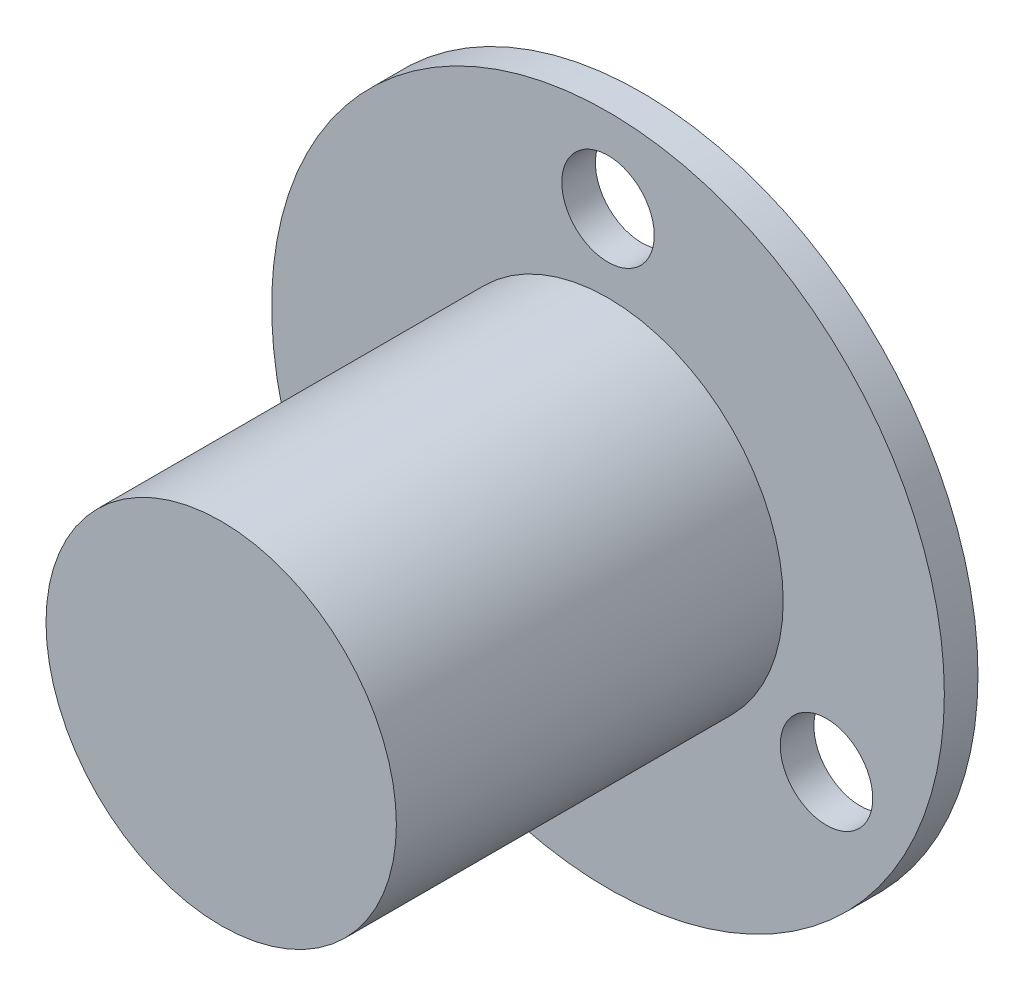
ISO-10303-21;
HEADER;
FILE_DESCRIPTION(('STEP AP214'),'2;1');
FILE_NAME('part.step','',(''),(''),'','','');
FILE_SCHEMA(('AUTOMOTIVE_DESIGN { 1 0 10303 214 1 1 1 1 }'));
ENDSEC;
DATA;
#1=APPLICATION_CONTEXT('core data for automotive mechanical design processes');
#2=APPLICATION_PROTOCOL_DEFINITION('international standard','automotive_design',2000,#1);
#3=PRODUCT_CONTEXT('',#1,'mechanical');
#4=PRODUCT('Part','Part','',(#3));
#5=PRODUCT_RELATED_PRODUCT_CATEGORY('part','',(#4));
#6=PRODUCT_DEFINITION_FORMATION('','',#4);
#7=PRODUCT_DEFINITION_CONTEXT('part definition',#1,'design');
#8=PRODUCT_DEFINITION('design','',#6,#7);
#9=PRODUCT_DEFINITION_SHAPE('','',#8);
#10=(LENGTH_UNIT() NAMED_UNIT(*) SI_UNIT(.MILLI.,.METRE.));
#11=(NAMED_UNIT(*) PLANE_ANGLE_UNIT() SI_UNIT($,.RADIAN.));
#12=(NAMED_UNIT(*) SI_UNIT($,.STERADIAN.) SOLID_ANGLE_UNIT());
#13=UNCERTAINTY_MEASURE_WITH_UNIT(LENGTH_MEASURE(1.E-05),#10,'distance_accuracy_value','');
#14=(GEOMETRIC_REPRESENTATION_CONTEXT(3) GLOBAL_UNCERTAINTY_ASSIGNED_CONTEXT((#13)) GLOBAL_UNIT_ASSIGNED_CONTEXT((#10,
#11,#12)) REPRESENTATION_CONTEXT('',''));
#15=CARTESIAN_POINT('',(0.,0.,0.));
#16=DIRECTION('',(0.,0.,1.));
#17=DIRECTION('',(1.,0.,0.));
#18=AXIS2_PLACEMENT_3D('',#15,#16,#17);
#19=CARTESIAN_POINT('',(0.,0.,1.2));
#20=DIRECTION('',(0.,0.,-1.));
#21=DIRECTION('',(-1.,0.,0.));
#22=AXIS2_PLACEMENT_3D('',#19,#20,#21);
#23=CYLINDRICAL_SURFACE('',#22,12.);
#24=CARTESIAN_POINT('',(0.,0.,1.2));
#25=DIRECTION('',(0.,0.,1.));
#26=DIRECTION('',(1.,0.,0.));
#27=AXIS2_PLACEMENT_3D('',#24,#25,#26);
#28=CIRCLE('',#27,12.);
#29=CARTESIAN_POINT('',(12.,0.,1.2));
#30=VERTEX_POINT('',#29);
#31=EDGE_CURVE('E47',#30,#30,#28,.T.);
#32=ORIENTED_EDGE('',*,*,#31,.F.);
#33=EDGE_LOOP('',(#32));
#34=FACE_BOUND('',#33,.T.);
#35=CARTESIAN_POINT('',(0.,0.,0.));
#36=DIRECTION('',(0.,0.,1.));
#37=DIRECTION('',(1.,0.,0.));
#38=AXIS2_PLACEMENT_3D('',#35,#36,#37);
#39=CIRCLE('',#38,12.);
#40=CARTESIAN_POINT('',(12.,0.,0.));
#41=VERTEX_POINT('',#40);
#42=EDGE_CURVE('E52',#41,#41,#39,.T.);
#43=ORIENTED_EDGE('',*,*,#42,.T.);
#44=EDGE_LOOP('',(#43));
#45=FACE_BOUND('',#44,.T.);
#46=ADVANCED_FACE('F37',(#34,#45),#23,.T.);
#47=CARTESIAN_POINT('',(0.,0.,1.2));
#48=DIRECTION('',(0.,0.,1.));
#49=DIRECTION('',(1.,0.,0.));
#50=AXIS2_PLACEMENT_3D('',#47,#48,#49);
#51=PLANE('',#50);
#52=CARTESIAN_POINT('',(0.,9.,1.2));
#53=DIRECTION('',(0.,0.,1.));
#54=DIRECTION('',(1.,0.,0.));
#55=AXIS2_PLACEMENT_3D('',#52,#53,#54);
#56=CIRCLE('',#55,1.65);
#57=CARTESIAN_POINT('',(1.65,9.,1.2));
#58=VERTEX_POINT('',#57);
#59=EDGE_CURVE('E65',#58,#58,#56,.T.);
#60=ORIENTED_EDGE('',*,*,#59,.F.);
#61=EDGE_LOOP('',(#60));
#62=FACE_BOUND('',#61,.T.);
#63=CARTESIAN_POINT('',(7.79422863405995,-4.49999999999999,1.2));
#64=DIRECTION('',(0.,0.,1.));
#65=DIRECTION('',(1.,0.,0.));
#66=AXIS2_PLACEMENT_3D('',#63,#64,#65);
#67=CIRCLE('',#66,1.65);
#68=CARTESIAN_POINT('',(9.44422863405995,-4.49999999999999,1.2));
#69=VERTEX_POINT('',#68);
#70=EDGE_CURVE('E70',#69,#69,#67,.T.);
#71=ORIENTED_EDGE('',*,*,#70,.F.);
#72=EDGE_LOOP('',(#71));
#73=FACE_BOUND('',#72,.T.);
#74=CARTESIAN_POINT('',(-7.79422863405994,-4.5,1.2));
#75=DIRECTION('',(0.,0.,1.));
#76=DIRECTION('',(1.,0.,0.));
#77=AXIS2_PLACEMENT_3D('',#74,#75,#76);
#78=CIRCLE('',#77,1.65);
#79=CARTESIAN_POINT('',(-6.14422863405995,-4.5,1.2));
#80=VERTEX_POINT('',#79);
#81=EDGE_CURVE('E80',#80,#80,#78,.T.);
#82=ORIENTED_EDGE('',*,*,#81,.F.);
#83=EDGE_LOOP('',(#82));
#84=FACE_BOUND('',#83,.T.);
#85=CARTESIAN_POINT('',(0.,0.,1.2));
#86=DIRECTION('',(0.,0.,1.));
#87=DIRECTION('',(1.,0.,0.));
#88=AXIS2_PLACEMENT_3D('',#85,#86,#87);
#89=CIRCLE('',#88,6.25);
#90=CARTESIAN_POINT('',(6.25,0.,1.2));
#91=VERTEX_POINT('',#90);
#92=EDGE_CURVE('E43',#91,#91,#89,.T.);
#93=ORIENTED_EDGE('',*,*,#92,.F.);
#94=EDGE_LOOP('',(#93));
#95=FACE_BOUND('',#94,.T.);
#96=ORIENTED_EDGE('',*,*,#31,.T.);
#97=EDGE_LOOP('',(#96));
#98=FACE_BOUND('',#97,.T.);
#99=ADVANCED_FACE('F105',(#62,#73,#84,#95,#98),#51,.T.);
#100=CARTESIAN_POINT('',(0.,0.,0.));
#101=DIRECTION('',(0.,0.,1.));
#102=DIRECTION('',(1.,0.,0.));
#103=AXIS2_PLACEMENT_3D('',#100,#101,#102);
#104=PLANE('',#103);
#105=CARTESIAN_POINT('',(0.,0.,0.));
#106=DIRECTION('',(0.,0.,1.));
#107=DIRECTION('',(1.,0.,0.));
#108=AXIS2_PLACEMENT_3D('',#105,#106,#107);
#109=CIRCLE('',#108,2.5);
#110=CARTESIAN_POINT('',(2.5,0.,0.));
#111=VERTEX_POINT('',#110);
#112=EDGE_CURVE('E10',#111,#111,#109,.F.);
#113=ORIENTED_EDGE('',*,*,#112,.F.);
#114=EDGE_LOOP('',(#113));
#115=FACE_BOUND('',#114,.T.);
#116=CARTESIAN_POINT('',(0.,9.,0.));
#117=DIRECTION('',(0.,0.,1.));
#118=DIRECTION('',(1.,0.,0.));
#119=AXIS2_PLACEMENT_3D('',#116,#117,#118);
#120=CIRCLE('',#119,1.65);
#121=CARTESIAN_POINT('',(1.65,9.,0.));
#122=VERTEX_POINT('',#121);
#123=EDGE_CURVE('E61',#122,#122,#120,.T.);
#124=ORIENTED_EDGE('',*,*,#123,.T.);
#125=EDGE_LOOP('',(#124));
#126=FACE_BOUND('',#125,.T.);
#127=CARTESIAN_POINT('',(7.79422863405995,-4.49999999999999,0.));
#128=DIRECTION('',(0.,0.,1.));
#129=DIRECTION('',(1.,0.,0.));
#130=AXIS2_PLACEMENT_3D('',#127,#128,#129);
#131=CIRCLE('',#130,1.65);
#132=CARTESIAN_POINT('',(9.44422863405995,-4.49999999999999,0.));
#133=VERTEX_POINT('',#132);
#134=EDGE_CURVE('E77',#133,#133,#131,.T.);
#135=ORIENTED_EDGE('',*,*,#134,.T.);
#136=EDGE_LOOP('',(#135));
#137=FACE_BOUND('',#136,.T.);
#138=CARTESIAN_POINT('',(-7.79422863405994,-4.5,0.));
#139=DIRECTION('',(0.,0.,1.));
#140=DIRECTION('',(1.,0.,0.));
#141=AXIS2_PLACEMENT_3D('',#138,#139,#140);
#142=CIRCLE('',#141,1.65);
#143=CARTESIAN_POINT('',(-6.14422863405995,-4.5,0.));
#144=VERTEX_POINT('',#143);
#145=EDGE_CURVE('E82',#144,#144,#142,.T.);
#146=ORIENTED_EDGE('',*,*,#145,.T.);
#147=EDGE_LOOP('',(#146));
#148=FACE_BOUND('',#147,.T.);
#149=ORIENTED_EDGE('',*,*,#42,.F.);
#150=EDGE_LOOP('',(#149));
#151=FACE_BOUND('',#150,.T.);
#152=ADVANCED_FACE('F111',(#115,#126,#137,#148,#151),#104,.F.);
#153=CARTESIAN_POINT('',(0.,0.,15.));
#154=DIRECTION('',(0.,0.,-1.));
#155=DIRECTION('',(-1.,0.,0.));
#156=AXIS2_PLACEMENT_3D('',#153,#154,#155);
#157=CYLINDRICAL_SURFACE('',#156,6.25);
#158=CARTESIAN_POINT('',(0.,0.,15.));
#159=DIRECTION('',(0.,0.,1.));
#160=DIRECTION('',(1.,0.,0.));
#161=AXIS2_PLACEMENT_3D('',#158,#159,#160);
#162=CIRCLE('',#161,6.25);
#163=CARTESIAN_POINT('',(6.25,0.,15.));
#164=VERTEX_POINT('',#163);
#165=EDGE_CURVE('E55',#164,#164,#162,.T.);
#166=ORIENTED_EDGE('',*,*,#165,.F.);
#167=EDGE_LOOP('',(#166));
#168=FACE_BOUND('',#167,.T.);
#169=ORIENTED_EDGE('',*,*,#92,.T.);
#170=EDGE_LOOP('',(#169));
#171=FACE_BOUND('',#170,.T.);
#172=ADVANCED_FACE('F120',(#168,#171),#157,.T.);
#173=CARTESIAN_POINT('',(0.,0.,15.));
#174=DIRECTION('',(0.,0.,1.));
#175=DIRECTION('',(1.,0.,0.));
#176=AXIS2_PLACEMENT_3D('',#173,#174,#175);
#177=PLANE('',#176);
#178=ORIENTED_EDGE('',*,*,#165,.T.);
#179=EDGE_LOOP('',(#178));
#180=FACE_BOUND('',#179,.T.);
#181=ADVANCED_FACE('F126',(#180),#177,.T.);
#182=CARTESIAN_POINT('',(-7.79422863405994,-4.5,0.));
#183=DIRECTION('',(0.,0.,1.));
#184=DIRECTION('',(1.,0.,0.));
#185=AXIS2_PLACEMENT_3D('',#182,#183,#184);
#186=CYLINDRICAL_SURFACE('',#185,1.65);
#187=ORIENTED_EDGE('',*,*,#145,.F.);
#188=EDGE_LOOP('',(#187));
#189=FACE_BOUND('',#188,.T.);
#190=ORIENTED_EDGE('',*,*,#81,.T.);
#191=EDGE_LOOP('',(#190));
#192=FACE_BOUND('',#191,.T.);
#193=ADVANCED_FACE('F129',(#189,#192),#186,.F.);
#194=CARTESIAN_POINT('',(7.79422863405995,-4.49999999999999,0.));
#195=DIRECTION('',(0.,0.,1.));
#196=DIRECTION('',(1.,0.,0.));
#197=AXIS2_PLACEMENT_3D('',#194,#195,#196);
#198=CYLINDRICAL_SURFACE('',#197,1.65);
#199=ORIENTED_EDGE('',*,*,#134,.F.);
#200=EDGE_LOOP('',(#199));
#201=FACE_BOUND('',#200,.T.);
#202=ORIENTED_EDGE('',*,*,#70,.T.);
#203=EDGE_LOOP('',(#202));
#204=FACE_BOUND('',#203,.T.);
#205=ADVANCED_FACE('F101',(#201,#204),#198,.F.);
#206=CARTESIAN_POINT('',(0.,9.,0.));
#207=DIRECTION('',(0.,0.,1.));
#208=DIRECTION('',(1.,0.,0.));
#209=AXIS2_PLACEMENT_3D('',#206,#207,#208);
#210=CYLINDRICAL_SURFACE('',#209,1.65);
#211=ORIENTED_EDGE('',*,*,#123,.F.);
#212=EDGE_LOOP('',(#211));
#213=FACE_BOUND('',#212,.T.);
#214=ORIENTED_EDGE('',*,*,#59,.T.);
#215=EDGE_LOOP('',(#214));
#216=FACE_BOUND('',#215,.T.);
#217=ADVANCED_FACE('F93',(#213,#216),#210,.F.);
#218=CARTESIAN_POINT('',(0.,0.,-1.5));
#219=DIRECTION('',(0.,0.,1.));
#220=DIRECTION('',(1.,0.,0.));
#221=AXIS2_PLACEMENT_3D('',#218,#219,#220);
#222=CYLINDRICAL_SURFACE('',#221,2.5);
#223=CARTESIAN_POINT('',(0.,0.,-1.5));
#224=DIRECTION('',(0.,0.,-1.));
#225=DIRECTION('',(-1.,0.,0.));
#226=AXIS2_PLACEMENT_3D('',#223,#224,#225);
#227=CIRCLE('',#226,2.5);
#228=CARTESIAN_POINT('',(-2.5,0.,-1.5));
#229=VERTEX_POINT('',#228);
#230=EDGE_CURVE('E73',#229,#229,#227,.T.);
#231=ORIENTED_EDGE('',*,*,#230,.F.);
#232=EDGE_LOOP('',(#231));
#233=FACE_BOUND('',#232,.T.);
#234=ORIENTED_EDGE('',*,*,#112,.T.);
#235=EDGE_LOOP('',(#234));
#236=FACE_BOUND('',#235,.T.);
#237=ADVANCED_FACE('F91',(#233,#236),#222,.T.);
#238=CARTESIAN_POINT('',(0.,0.,-1.5));
#239=DIRECTION('',(0.,0.,-1.));
#240=DIRECTION('',(-1.,0.,0.));
#241=AXIS2_PLACEMENT_3D('',#238,#239,#240);
#242=PLANE('',#241);
#243=ORIENTED_EDGE('',*,*,#230,.T.);
#244=EDGE_LOOP('',(#243));
#245=FACE_BOUND('',#244,.T.);
#246=ADVANCED_FACE('F89',(#245),#242,.T.);
#247=CLOSED_SHELL('',(#46,#99,#152,#172,#181,#193,#205,#217,#237,#246));
#248=MANIFOLD_SOLID_BREP('B2',#247);
#249=ADVANCED_BREP_SHAPE_REPRESENTATION('',(#18,#248),#14);
#250=SHAPE_DEFINITION_REPRESENTATION(#9,#249);
ENDSEC;
END-ISO-10303-21;
